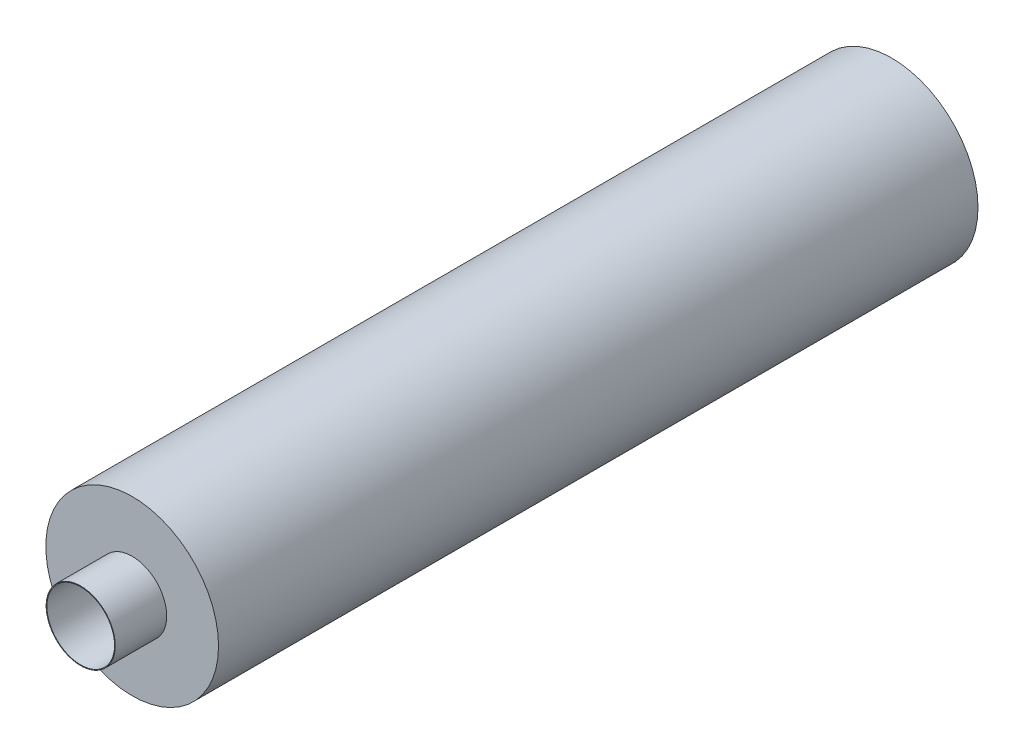
ISO-10303-21;
HEADER;
FILE_DESCRIPTION(('STEP AP214'),'2;1');
FILE_NAME('part.step','',(''),(''),'','','');
FILE_SCHEMA(('AUTOMOTIVE_DESIGN { 1 0 10303 214 1 1 1 1 }'));
ENDSEC;
DATA;
#1=APPLICATION_CONTEXT('core data for automotive mechanical design processes');
#2=APPLICATION_PROTOCOL_DEFINITION('international standard','automotive_design',2000,#1);
#3=PRODUCT_CONTEXT('',#1,'mechanical');
#4=PRODUCT('Part','Part','',(#3));
#5=PRODUCT_RELATED_PRODUCT_CATEGORY('part','',(#4));
#6=PRODUCT_DEFINITION_FORMATION('','',#4);
#7=PRODUCT_DEFINITION_CONTEXT('part definition',#1,'design');
#8=PRODUCT_DEFINITION('design','',#6,#7);
#9=PRODUCT_DEFINITION_SHAPE('','',#8);
#10=(LENGTH_UNIT() NAMED_UNIT(*) SI_UNIT(.MILLI.,.METRE.));
#11=(NAMED_UNIT(*) PLANE_ANGLE_UNIT() SI_UNIT($,.RADIAN.));
#12=(NAMED_UNIT(*) SI_UNIT($,.STERADIAN.) SOLID_ANGLE_UNIT());
#13=UNCERTAINTY_MEASURE_WITH_UNIT(LENGTH_MEASURE(1.E-05),#10,'distance_accuracy_value','');
#14=(GEOMETRIC_REPRESENTATION_CONTEXT(3) GLOBAL_UNCERTAINTY_ASSIGNED_CONTEXT((#13)) GLOBAL_UNIT_ASSIGNED_CONTEXT((#10,
#11,#12)) REPRESENTATION_CONTEXT('',''));
#15=CARTESIAN_POINT('',(0.,0.,0.));
#16=DIRECTION('',(0.,0.,1.));
#17=DIRECTION('',(1.,0.,0.));
#18=AXIS2_PLACEMENT_3D('',#15,#16,#17);
#19=CARTESIAN_POINT('',(0.,0.,2198.));
#20=DIRECTION('',(0.,0.,1.));
#21=DIRECTION('',(1.,0.,0.));
#22=AXIS2_PLACEMENT_3D('',#19,#20,#21);
#23=PLANE('',#22);
#24=CARTESIAN_POINT('',(0.,0.,2198.));
#25=DIRECTION('',(0.,0.,1.));
#26=DIRECTION('',(1.,0.,0.));
#27=AXIS2_PLACEMENT_3D('',#24,#25,#26);
#28=CIRCLE('',#27,98.);
#29=CARTESIAN_POINT('',(98.,0.,2198.));
#30=VERTEX_POINT('',#29);
#31=EDGE_CURVE('E63',#30,#30,#28,.T.);
#32=ORIENTED_EDGE('',*,*,#31,.T.);
#33=EDGE_LOOP('',(#32));
#34=FACE_BOUND('',#33,.T.);
#35=CARTESIAN_POINT('',(0.,0.,2198.));
#36=DIRECTION('',(0.,0.,1.));
#37=DIRECTION('',(1.,0.,0.));
#38=AXIS2_PLACEMENT_3D('',#35,#36,#37);
#39=CIRCLE('',#38,248.);
#40=CARTESIAN_POINT('',(248.,0.,2198.));
#41=VERTEX_POINT('',#40);
#42=EDGE_CURVE('E55',#41,#41,#39,.T.);
#43=ORIENTED_EDGE('',*,*,#42,.F.);
#44=EDGE_LOOP('',(#43));
#45=FACE_BOUND('',#44,.T.);
#46=ADVANCED_FACE('F43',(#34,#45),#23,.F.);
#47=CARTESIAN_POINT('',(0.,0.,2199.));
#48=DIRECTION('',(0.,0.,-1.));
#49=DIRECTION('',(-1.,0.,0.));
#50=AXIS2_PLACEMENT_3D('',#47,#48,#49);
#51=CYLINDRICAL_SURFACE('',#50,98.);
#52=ORIENTED_EDGE('',*,*,#31,.F.);
#53=EDGE_LOOP('',(#52));
#54=FACE_BOUND('',#53,.T.);
#55=CARTESIAN_POINT('',(0.,0.,2348.));
#56=DIRECTION('',(0.,0.,1.));
#57=DIRECTION('',(1.,0.,0.));
#58=AXIS2_PLACEMENT_3D('',#55,#56,#57);
#59=CIRCLE('',#58,98.);
#60=CARTESIAN_POINT('',(98.,0.,2348.));
#61=VERTEX_POINT('',#60);
#62=EDGE_CURVE('E69',#61,#61,#59,.T.);
#63=ORIENTED_EDGE('',*,*,#62,.T.);
#64=EDGE_LOOP('',(#63));
#65=FACE_BOUND('',#64,.T.);
#66=ADVANCED_FACE('F73',(#54,#65),#51,.F.);
#67=CARTESIAN_POINT('',(0.,0.,2.));
#68=DIRECTION('',(0.,0.,1.));
#69=DIRECTION('',(1.,0.,0.));
#70=AXIS2_PLACEMENT_3D('',#67,#68,#69);
#71=PLANE('',#70);
#72=CARTESIAN_POINT('',(0.,0.,1.99999999999978));
#73=DIRECTION('',(0.,0.,1.));
#74=DIRECTION('',(1.,0.,0.));
#75=AXIS2_PLACEMENT_3D('',#72,#73,#74);
#76=CIRCLE('',#75,248.);
#77=CARTESIAN_POINT('',(248.,0.,1.99999999999978));
#78=VERTEX_POINT('',#77);
#79=EDGE_CURVE('E51',#78,#78,#76,.T.);
#80=ORIENTED_EDGE('',*,*,#79,.T.);
#81=EDGE_LOOP('',(#80));
#82=FACE_BOUND('',#81,.T.);
#83=ADVANCED_FACE('F88',(#82),#71,.T.);
#84=CARTESIAN_POINT('',(0.,0.,2198.));
#85=DIRECTION('',(0.,0.,-1.));
#86=DIRECTION('',(-1.,0.,0.));
#87=AXIS2_PLACEMENT_3D('',#84,#85,#86);
#88=CYLINDRICAL_SURFACE('',#87,248.);
#89=ORIENTED_EDGE('',*,*,#42,.T.);
#90=EDGE_LOOP('',(#89));
#91=FACE_BOUND('',#90,.T.);
#92=ORIENTED_EDGE('',*,*,#79,.F.);
#93=EDGE_LOOP('',(#92));
#94=FACE_BOUND('',#93,.T.);
#95=ADVANCED_FACE('F78',(#91,#94),#88,.F.);
#96=CARTESIAN_POINT('',(0.,0.,2348.));
#97=DIRECTION('',(0.,0.,1.));
#98=DIRECTION('',(1.,0.,0.));
#99=AXIS2_PLACEMENT_3D('',#96,#97,#98);
#100=PLANE('',#99);
#101=CARTESIAN_POINT('',(0.,0.,2348.));
#102=DIRECTION('',(0.,0.,1.));
#103=DIRECTION('',(1.,0.,0.));
#104=AXIS2_PLACEMENT_3D('',#101,#102,#103);
#105=CIRCLE('',#104,100.);
#106=CARTESIAN_POINT('',(100.,0.,2348.));
#107=VERTEX_POINT('',#106);
#108=EDGE_CURVE('E66',#107,#107,#105,.T.);
#109=ORIENTED_EDGE('',*,*,#108,.T.);
#110=EDGE_LOOP('',(#109));
#111=FACE_BOUND('',#110,.T.);
#112=ORIENTED_EDGE('',*,*,#62,.F.);
#113=EDGE_LOOP('',(#112));
#114=FACE_BOUND('',#113,.T.);
#115=ADVANCED_FACE('F75',(#111,#114),#100,.T.);
#116=CARTESIAN_POINT('',(0.,0.,2348.));
#117=DIRECTION('',(0.,0.,-1.));
#118=DIRECTION('',(-1.,0.,0.));
#119=AXIS2_PLACEMENT_3D('',#116,#117,#118);
#120=CYLINDRICAL_SURFACE('',#119,100.);
#121=CARTESIAN_POINT('',(0.,0.,2199.));
#122=DIRECTION('',(0.,0.,1.));
#123=DIRECTION('',(1.,0.,0.));
#124=AXIS2_PLACEMENT_3D('',#121,#122,#123);
#125=CIRCLE('',#124,100.);
#126=CARTESIAN_POINT('',(100.,0.,2199.));
#127=VERTEX_POINT('',#126);
#128=EDGE_CURVE('E47',#127,#127,#125,.F.);
#129=ORIENTED_EDGE('',*,*,#128,.F.);
#130=EDGE_LOOP('',(#129));
#131=FACE_BOUND('',#130,.T.);
#132=ORIENTED_EDGE('',*,*,#108,.F.);
#133=EDGE_LOOP('',(#132));
#134=FACE_BOUND('',#133,.T.);
#135=ADVANCED_FACE('F77',(#131,#134),#120,.T.);
#136=CARTESIAN_POINT('',(0.,0.,0.));
#137=DIRECTION('',(0.,0.,1.));
#138=DIRECTION('',(1.,0.,0.));
#139=AXIS2_PLACEMENT_3D('',#136,#137,#138);
#140=PLANE('',#139);
#141=CARTESIAN_POINT('',(0.,0.,0.));
#142=DIRECTION('',(0.,0.,1.));
#143=DIRECTION('',(1.,0.,0.));
#144=AXIS2_PLACEMENT_3D('',#141,#142,#143);
#145=CIRCLE('',#144,250.);
#146=CARTESIAN_POINT('',(250.,0.,0.));
#147=VERTEX_POINT('',#146);
#148=EDGE_CURVE('E11',#147,#147,#145,.T.);
#149=ORIENTED_EDGE('',*,*,#148,.F.);
#150=EDGE_LOOP('',(#149));
#151=FACE_BOUND('',#150,.T.);
#152=ADVANCED_FACE('F85',(#151),#140,.F.);
#153=CARTESIAN_POINT('',(0.,0.,2198.));
#154=DIRECTION('',(0.,0.,-1.));
#155=DIRECTION('',(-1.,0.,0.));
#156=AXIS2_PLACEMENT_3D('',#153,#154,#155);
#157=CYLINDRICAL_SURFACE('',#156,250.);
#158=ORIENTED_EDGE('',*,*,#148,.T.);
#159=EDGE_LOOP('',(#158));
#160=FACE_BOUND('',#159,.T.);
#161=CARTESIAN_POINT('',(0.,0.,2199.));
#162=DIRECTION('',(0.,0.,1.));
#163=DIRECTION('',(1.,0.,0.));
#164=AXIS2_PLACEMENT_3D('',#161,#162,#163);
#165=CIRCLE('',#164,250.);
#166=CARTESIAN_POINT('',(250.,0.,2199.));
#167=VERTEX_POINT('',#166);
#168=EDGE_CURVE('E59',#167,#167,#165,.T.);
#169=ORIENTED_EDGE('',*,*,#168,.F.);
#170=EDGE_LOOP('',(#169));
#171=FACE_BOUND('',#170,.T.);
#172=ADVANCED_FACE('F45',(#160,#171),#157,.T.);
#173=CARTESIAN_POINT('',(0.,0.,2199.));
#174=DIRECTION('',(0.,0.,1.));
#175=DIRECTION('',(1.,0.,0.));
#176=AXIS2_PLACEMENT_3D('',#173,#174,#175);
#177=PLANE('',#176);
#178=ORIENTED_EDGE('',*,*,#168,.T.);
#179=EDGE_LOOP('',(#178));
#180=FACE_BOUND('',#179,.T.);
#181=ORIENTED_EDGE('',*,*,#128,.T.);
#182=EDGE_LOOP('',(#181));
#183=FACE_BOUND('',#182,.T.);
#184=ADVANCED_FACE('F101',(#180,#183),#177,.T.);
#185=CLOSED_SHELL('',(#46,#66,#83,#95,#115,#135,#152,#172,#184));
#186=MANIFOLD_SOLID_BREP('B2',#185);
#187=ADVANCED_BREP_SHAPE_REPRESENTATION('',(#18,#186),#14);
#188=SHAPE_DEFINITION_REPRESENTATION(#9,#187);
ENDSEC;
END-ISO-10303-21;
